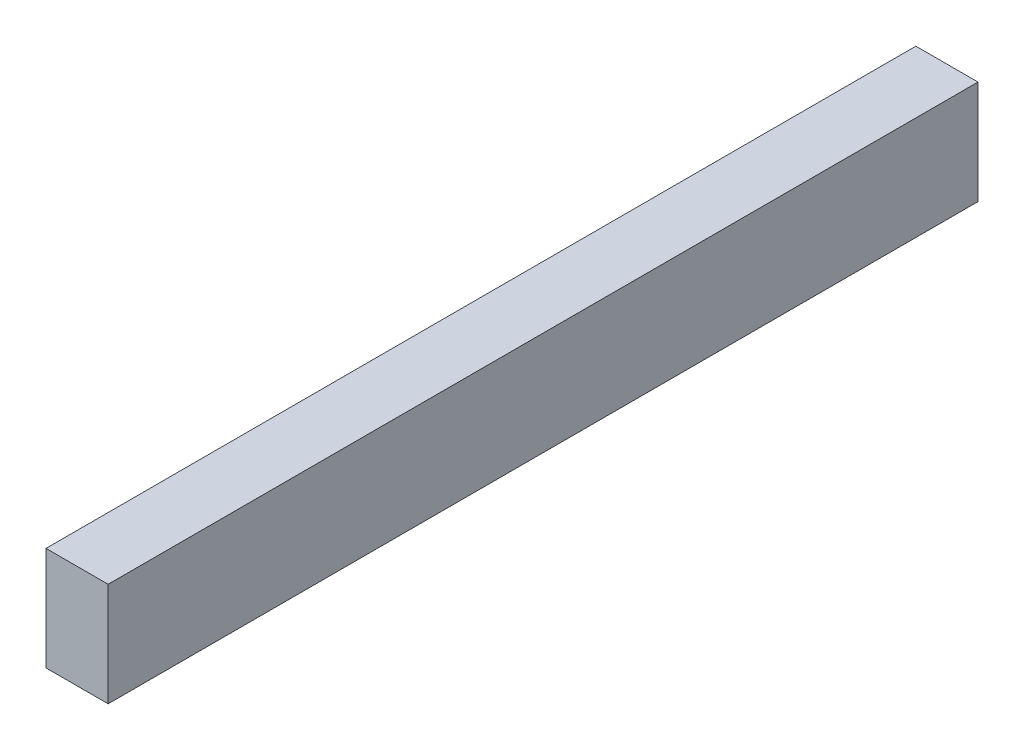
ISO-10303-21;
HEADER;
FILE_DESCRIPTION(('STEP AP214'),'2;1');
FILE_NAME('part.step','',(''),(''),'','','');
FILE_SCHEMA(('AUTOMOTIVE_DESIGN { 1 0 10303 214 1 1 1 1 }'));
ENDSEC;
DATA;
#1=APPLICATION_CONTEXT('core data for automotive mechanical design processes');
#2=APPLICATION_PROTOCOL_DEFINITION('international standard','automotive_design',2000,#1);
#3=PRODUCT_CONTEXT('',#1,'mechanical');
#4=PRODUCT('Part','Part','',(#3));
#5=PRODUCT_RELATED_PRODUCT_CATEGORY('part','',(#4));
#6=PRODUCT_DEFINITION_FORMATION('','',#4);
#7=PRODUCT_DEFINITION_CONTEXT('part definition',#1,'design');
#8=PRODUCT_DEFINITION('design','',#6,#7);
#9=PRODUCT_DEFINITION_SHAPE('','',#8);
#10=(LENGTH_UNIT() NAMED_UNIT(*) SI_UNIT(.MILLI.,.METRE.));
#11=(NAMED_UNIT(*) PLANE_ANGLE_UNIT() SI_UNIT($,.RADIAN.));
#12=(NAMED_UNIT(*) SI_UNIT($,.STERADIAN.) SOLID_ANGLE_UNIT());
#13=UNCERTAINTY_MEASURE_WITH_UNIT(LENGTH_MEASURE(1.E-05),#10,'distance_accuracy_value','');
#14=(GEOMETRIC_REPRESENTATION_CONTEXT(3) GLOBAL_UNCERTAINTY_ASSIGNED_CONTEXT((#13)) GLOBAL_UNIT_ASSIGNED_CONTEXT((#10,
#11,#12)) REPRESENTATION_CONTEXT('',''));
#15=CARTESIAN_POINT('',(0.,0.,0.));
#16=DIRECTION('',(0.,0.,1.));
#17=DIRECTION('',(1.,0.,0.));
#18=AXIS2_PLACEMENT_3D('',#15,#16,#17);
#19=CARTESIAN_POINT('',(19.05,-31.75,533.4));
#20=DIRECTION('',(-1.,0.,0.));
#21=DIRECTION('',(0.,0.,1.));
#22=AXIS2_PLACEMENT_3D('',#19,#20,#21);
#23=PLANE('',#22);
#24=DIRECTION('',(0.,1.,0.));
#25=VECTOR('',#24,1.);
#26=CARTESIAN_POINT('',(19.05,-31.75,0.));
#27=LINE('',#26,#25);
#28=CARTESIAN_POINT('',(19.05,-31.75,0.));
#29=VERTEX_POINT('',#28);
#30=CARTESIAN_POINT('',(19.05,31.75,0.));
#31=VERTEX_POINT('',#30);
#32=EDGE_CURVE('E96',#29,#31,#27,.T.);
#33=ORIENTED_EDGE('',*,*,#32,.T.);
#34=DIRECTION('',(0.,0.,-1.));
#35=VECTOR('',#34,1.);
#36=CARTESIAN_POINT('',(19.05,31.75,533.4));
#37=LINE('',#36,#35);
#38=CARTESIAN_POINT('',(19.05,31.75,533.4));
#39=VERTEX_POINT('',#38);
#40=EDGE_CURVE('E11',#39,#31,#37,.T.);
#41=ORIENTED_EDGE('',*,*,#40,.F.);
#42=DIRECTION('',(0.,1.,0.));
#43=VECTOR('',#42,1.);
#44=CARTESIAN_POINT('',(19.05,-31.75,533.4));
#45=LINE('',#44,#43);
#46=CARTESIAN_POINT('',(19.05,-31.75,533.4));
#47=VERTEX_POINT('',#46);
#48=EDGE_CURVE('E84',#47,#39,#45,.T.);
#49=ORIENTED_EDGE('',*,*,#48,.F.);
#50=DIRECTION('',(0.,0.,-1.));
#51=VECTOR('',#50,1.);
#52=CARTESIAN_POINT('',(19.05,-31.75,533.4));
#53=LINE('',#52,#51);
#54=EDGE_CURVE('E92',#47,#29,#53,.T.);
#55=ORIENTED_EDGE('',*,*,#54,.T.);
#56=EDGE_LOOP('',(#33,#41,#49,#55));
#57=FACE_BOUND('',#56,.T.);
#58=ADVANCED_FACE('F33',(#57),#23,.F.);
#59=CARTESIAN_POINT('',(-19.05,31.75,533.4));
#60=DIRECTION('',(0.,-1.,0.));
#61=DIRECTION('',(0.,0.,-1.));
#62=AXIS2_PLACEMENT_3D('',#59,#60,#61);
#63=PLANE('',#62);
#64=DIRECTION('',(-1.,0.,0.));
#65=VECTOR('',#64,1.);
#66=CARTESIAN_POINT('',(-19.05,31.75,0.));
#67=LINE('',#66,#65);
#68=CARTESIAN_POINT('',(-19.05,31.75,0.));
#69=VERTEX_POINT('',#68);
#70=EDGE_CURVE('E88',#31,#69,#67,.T.);
#71=ORIENTED_EDGE('',*,*,#70,.T.);
#72=DIRECTION('',(0.,0.,-1.));
#73=VECTOR('',#72,1.);
#74=CARTESIAN_POINT('',(-19.05,31.75,533.4));
#75=LINE('',#74,#73);
#76=CARTESIAN_POINT('',(-19.05,31.75,533.4));
#77=VERTEX_POINT('',#76);
#78=EDGE_CURVE('E41',#77,#69,#75,.T.);
#79=ORIENTED_EDGE('',*,*,#78,.F.);
#80=DIRECTION('',(-1.,0.,0.));
#81=VECTOR('',#80,1.);
#82=CARTESIAN_POINT('',(-19.05,31.75,533.4));
#83=LINE('',#82,#81);
#84=EDGE_CURVE('E79',#39,#77,#83,.T.);
#85=ORIENTED_EDGE('',*,*,#84,.F.);
#86=ORIENTED_EDGE('',*,*,#40,.T.);
#87=EDGE_LOOP('',(#71,#79,#85,#86));
#88=FACE_BOUND('',#87,.T.);
#89=ADVANCED_FACE('F87',(#88),#63,.F.);
#90=CARTESIAN_POINT('',(-19.05,-31.75,533.4));
#91=DIRECTION('',(1.,0.,0.));
#92=DIRECTION('',(0.,0.,-1.));
#93=AXIS2_PLACEMENT_3D('',#90,#91,#92);
#94=PLANE('',#93);
#95=DIRECTION('',(0.,-1.,0.));
#96=VECTOR('',#95,1.);
#97=CARTESIAN_POINT('',(-19.05,-31.75,0.));
#98=LINE('',#97,#96);
#99=CARTESIAN_POINT('',(-19.05,-31.75,0.));
#100=VERTEX_POINT('',#99);
#101=EDGE_CURVE('E66',#69,#100,#98,.T.);
#102=ORIENTED_EDGE('',*,*,#101,.T.);
#103=DIRECTION('',(0.,0.,-1.));
#104=VECTOR('',#103,1.);
#105=CARTESIAN_POINT('',(-19.05,-31.75,533.4));
#106=LINE('',#105,#104);
#107=CARTESIAN_POINT('',(-19.05,-31.75,533.4));
#108=VERTEX_POINT('',#107);
#109=EDGE_CURVE('E89',#108,#100,#106,.T.);
#110=ORIENTED_EDGE('',*,*,#109,.F.);
#111=DIRECTION('',(0.,-1.,0.));
#112=VECTOR('',#111,1.);
#113=CARTESIAN_POINT('',(-19.05,-31.75,533.4));
#114=LINE('',#113,#112);
#115=EDGE_CURVE('E82',#77,#108,#114,.T.);
#116=ORIENTED_EDGE('',*,*,#115,.F.);
#117=ORIENTED_EDGE('',*,*,#78,.T.);
#118=EDGE_LOOP('',(#102,#110,#116,#117));
#119=FACE_BOUND('',#118,.T.);
#120=ADVANCED_FACE('F90',(#119),#94,.F.);
#121=CARTESIAN_POINT('',(-19.05,-31.75,533.4));
#122=DIRECTION('',(0.,1.,0.));
#123=DIRECTION('',(0.,0.,1.));
#124=AXIS2_PLACEMENT_3D('',#121,#122,#123);
#125=PLANE('',#124);
#126=DIRECTION('',(1.,0.,0.));
#127=VECTOR('',#126,1.);
#128=CARTESIAN_POINT('',(-19.05,-31.75,0.));
#129=LINE('',#128,#127);
#130=EDGE_CURVE('E72',#100,#29,#129,.T.);
#131=ORIENTED_EDGE('',*,*,#130,.T.);
#132=ORIENTED_EDGE('',*,*,#54,.F.);
#133=DIRECTION('',(1.,0.,0.));
#134=VECTOR('',#133,1.);
#135=CARTESIAN_POINT('',(-19.05,-31.75,533.4));
#136=LINE('',#135,#134);
#137=EDGE_CURVE('E49',#108,#47,#136,.T.);
#138=ORIENTED_EDGE('',*,*,#137,.F.);
#139=ORIENTED_EDGE('',*,*,#109,.T.);
#140=EDGE_LOOP('',(#131,#132,#138,#139));
#141=FACE_BOUND('',#140,.T.);
#142=ADVANCED_FACE('F103',(#141),#125,.F.);
#143=CARTESIAN_POINT('',(0.,0.,533.4));
#144=DIRECTION('',(0.,0.,-1.));
#145=DIRECTION('',(-1.,0.,0.));
#146=AXIS2_PLACEMENT_3D('',#143,#144,#145);
#147=PLANE('',#146);
#148=ORIENTED_EDGE('',*,*,#48,.T.);
#149=ORIENTED_EDGE('',*,*,#84,.T.);
#150=ORIENTED_EDGE('',*,*,#115,.T.);
#151=ORIENTED_EDGE('',*,*,#137,.T.);
#152=EDGE_LOOP('',(#148,#149,#150,#151));
#153=FACE_BOUND('',#152,.T.);
#154=ADVANCED_FACE('F80',(#153),#147,.F.);
#155=CARTESIAN_POINT('',(0.,0.,0.));
#156=DIRECTION('',(0.,0.,-1.));
#157=DIRECTION('',(-1.,0.,0.));
#158=AXIS2_PLACEMENT_3D('',#155,#156,#157);
#159=PLANE('',#158);
#160=ORIENTED_EDGE('',*,*,#32,.F.);
#161=ORIENTED_EDGE('',*,*,#130,.F.);
#162=ORIENTED_EDGE('',*,*,#101,.F.);
#163=ORIENTED_EDGE('',*,*,#70,.F.);
#164=EDGE_LOOP('',(#160,#161,#162,#163));
#165=FACE_BOUND('',#164,.T.);
#166=ADVANCED_FACE('F106',(#165),#159,.T.);
#167=CLOSED_SHELL('',(#58,#89,#120,#142,#154,#166));
#168=MANIFOLD_SOLID_BREP('B2',#167);
#169=ADVANCED_BREP_SHAPE_REPRESENTATION('',(#18,#168),#14);
#170=SHAPE_DEFINITION_REPRESENTATION(#9,#169);
ENDSEC;
END-ISO-10303-21;
